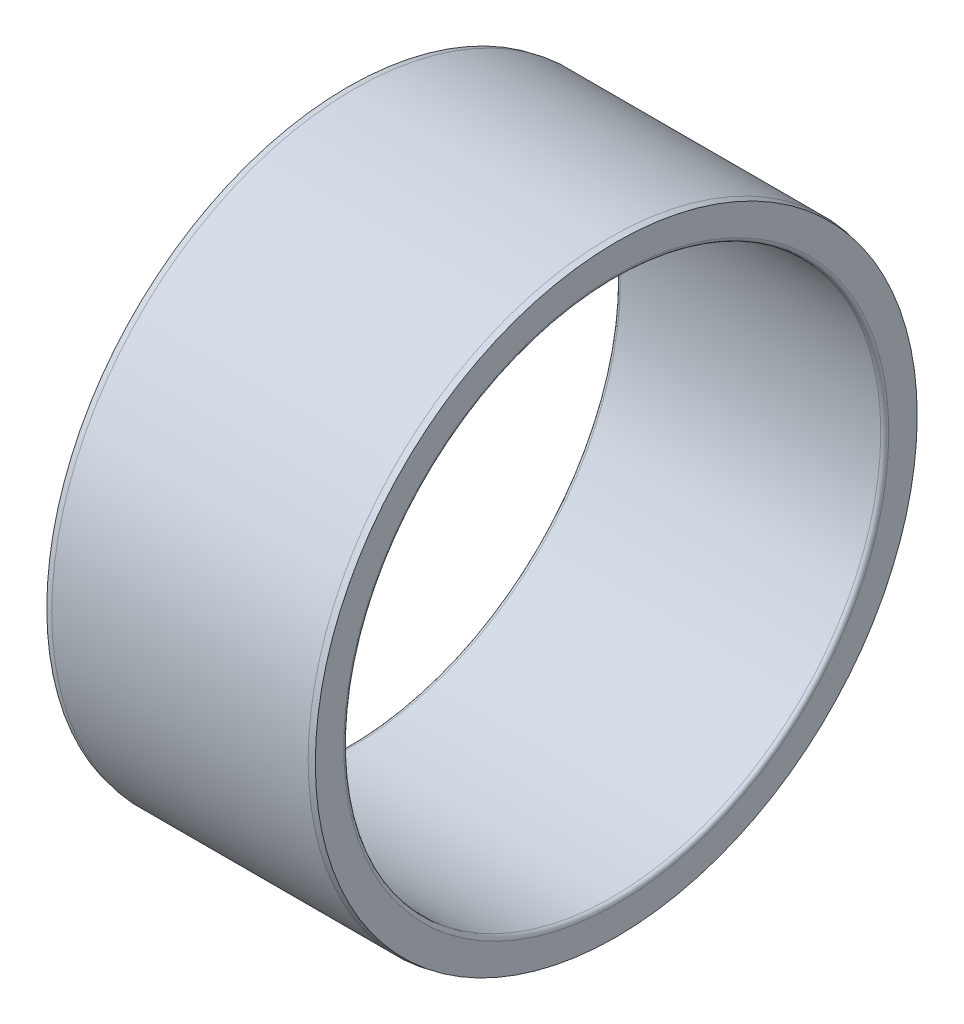
ISO-10303-21;
HEADER;
FILE_DESCRIPTION(('STEP AP214'),'2;1');
FILE_NAME('part.step','',(''),(''),'','','');
FILE_SCHEMA(('AUTOMOTIVE_DESIGN { 1 0 10303 214 1 1 1 1 }'));
ENDSEC;
DATA;
#1=APPLICATION_CONTEXT('core data for automotive mechanical design processes');
#2=APPLICATION_PROTOCOL_DEFINITION('international standard','automotive_design',2000,#1);
#3=PRODUCT_CONTEXT('',#1,'mechanical');
#4=PRODUCT('Part','Part','',(#3));
#5=PRODUCT_RELATED_PRODUCT_CATEGORY('part','',(#4));
#6=PRODUCT_DEFINITION_FORMATION('','',#4);
#7=PRODUCT_DEFINITION_CONTEXT('part definition',#1,'design');
#8=PRODUCT_DEFINITION('design','',#6,#7);
#9=PRODUCT_DEFINITION_SHAPE('','',#8);
#10=(LENGTH_UNIT() NAMED_UNIT(*) SI_UNIT(.MILLI.,.METRE.));
#11=(NAMED_UNIT(*) PLANE_ANGLE_UNIT() SI_UNIT($,.RADIAN.));
#12=(NAMED_UNIT(*) SI_UNIT($,.STERADIAN.) SOLID_ANGLE_UNIT());
#13=UNCERTAINTY_MEASURE_WITH_UNIT(LENGTH_MEASURE(1.E-05),#10,'distance_accuracy_value','');
#14=(GEOMETRIC_REPRESENTATION_CONTEXT(3) GLOBAL_UNCERTAINTY_ASSIGNED_CONTEXT((#13)) GLOBAL_UNIT_ASSIGNED_CONTEXT((#10,
#11,#12)) REPRESENTATION_CONTEXT('',''));
#15=CARTESIAN_POINT('',(0.,0.,0.));
#16=DIRECTION('',(0.,0.,1.));
#17=DIRECTION('',(1.,0.,0.));
#18=AXIS2_PLACEMENT_3D('',#15,#16,#17);
#19=CARTESIAN_POINT('',(0.,22.41563,0.));
#20=DIRECTION('',(-1.,0.,0.));
#21=DIRECTION('',(0.,0.,1.));
#22=AXIS2_PLACEMENT_3D('',#19,#20,#21);
#23=PLANE('',#22);
#24=CARTESIAN_POINT('',(0.,0.,0.));
#25=DIRECTION('',(1.,0.,0.));
#26=DIRECTION('',(0.,0.,-1.));
#27=AXIS2_PLACEMENT_3D('',#24,#25,#26);
#28=CIRCLE('',#27,20.3);
#29=CARTESIAN_POINT('',(0.,0.,-20.3));
#30=VERTEX_POINT('',#29);
#31=EDGE_CURVE('E44',#30,#30,#28,.T.);
#32=ORIENTED_EDGE('',*,*,#31,.T.);
#33=EDGE_LOOP('',(#32));
#34=FACE_BOUND('',#33,.T.);
#35=CARTESIAN_POINT('',(0.,0.,0.));
#36=DIRECTION('',(1.,0.,0.));
#37=DIRECTION('',(0.,0.,-1.));
#38=AXIS2_PLACEMENT_3D('',#35,#36,#37);
#39=CIRCLE('',#38,22.41563);
#40=CARTESIAN_POINT('',(0.,0.,-22.41563));
#41=VERTEX_POINT('',#40);
#42=EDGE_CURVE('E41',#41,#41,#39,.T.);
#43=ORIENTED_EDGE('',*,*,#42,.F.);
#44=EDGE_LOOP('',(#43));
#45=FACE_BOUND('',#44,.T.);
#46=ADVANCED_FACE('F15',(#34,#45),#23,.T.);
#47=CARTESIAN_POINT('',(0.299999999999941,0.,0.));
#48=DIRECTION('',(1.,0.,0.));
#49=DIRECTION('',(0.,0.,-1.));
#50=AXIS2_PLACEMENT_3D('',#47,#48,#49);
#51=TOROIDAL_SURFACE('',#50,20.3,0.299999999999941);
#52=CARTESIAN_POINT('',(0.3,0.,0.));
#53=DIRECTION('',(1.,0.,0.));
#54=DIRECTION('',(0.,0.,-1.));
#55=AXIS2_PLACEMENT_3D('',#52,#53,#54);
#56=CIRCLE('',#55,20.);
#57=CARTESIAN_POINT('',(0.3,0.,-20.));
#58=VERTEX_POINT('',#57);
#59=EDGE_CURVE('E38',#58,#58,#56,.T.);
#60=ORIENTED_EDGE('',*,*,#59,.T.);
#61=EDGE_LOOP('',(#60));
#62=FACE_BOUND('',#61,.T.);
#63=ORIENTED_EDGE('',*,*,#31,.F.);
#64=EDGE_LOOP('',(#63));
#65=FACE_BOUND('',#64,.T.);
#66=ADVANCED_FACE('F50',(#62,#65),#51,.T.);
#67=CARTESIAN_POINT('',(0.45,0.,0.));
#68=DIRECTION('',(1.,0.,0.));
#69=DIRECTION('',(0.,0.,-1.));
#70=AXIS2_PLACEMENT_3D('',#67,#68,#69);
#71=CONICAL_SURFACE('',#70,22.5,0.185337216221465);
#72=ORIENTED_EDGE('',*,*,#42,.T.);
#73=EDGE_LOOP('',(#72));
#74=FACE_BOUND('',#73,.T.);
#75=CARTESIAN_POINT('',(0.449999999999999,0.,0.));
#76=DIRECTION('',(1.,0.,0.));
#77=DIRECTION('',(0.,0.,-1.));
#78=AXIS2_PLACEMENT_3D('',#75,#76,#77);
#79=CIRCLE('',#78,22.5);
#80=CARTESIAN_POINT('',(0.449999999999999,0.,-22.5));
#81=VERTEX_POINT('',#80);
#82=EDGE_CURVE('E35',#81,#81,#79,.T.);
#83=ORIENTED_EDGE('',*,*,#82,.F.);
#84=EDGE_LOOP('',(#83));
#85=FACE_BOUND('',#84,.T.);
#86=ADVANCED_FACE('F52',(#74,#85),#71,.T.);
#87=CARTESIAN_POINT('',(20.,0.,0.));
#88=DIRECTION('',(1.,0.,0.));
#89=DIRECTION('',(0.,0.,-1.));
#90=AXIS2_PLACEMENT_3D('',#87,#88,#89);
#91=CYLINDRICAL_SURFACE('',#90,20.);
#92=CARTESIAN_POINT('',(19.7,0.,0.));
#93=DIRECTION('',(1.,0.,0.));
#94=DIRECTION('',(0.,0.,-1.));
#95=AXIS2_PLACEMENT_3D('',#92,#93,#94);
#96=CIRCLE('',#95,20.);
#97=CARTESIAN_POINT('',(19.7,0.,-20.));
#98=VERTEX_POINT('',#97);
#99=EDGE_CURVE('E30',#98,#98,#96,.T.);
#100=ORIENTED_EDGE('',*,*,#99,.T.);
#101=EDGE_LOOP('',(#100));
#102=FACE_BOUND('',#101,.T.);
#103=ORIENTED_EDGE('',*,*,#59,.F.);
#104=EDGE_LOOP('',(#103));
#105=FACE_BOUND('',#104,.T.);
#106=ADVANCED_FACE('F60',(#102,#105),#91,.F.);
#107=CARTESIAN_POINT('',(20.,0.,0.));
#108=DIRECTION('',(1.,0.,0.));
#109=DIRECTION('',(0.,0.,-1.));
#110=AXIS2_PLACEMENT_3D('',#107,#108,#109);
#111=CYLINDRICAL_SURFACE('',#110,22.5);
#112=ORIENTED_EDGE('',*,*,#82,.T.);
#113=EDGE_LOOP('',(#112));
#114=FACE_BOUND('',#113,.T.);
#115=CARTESIAN_POINT('',(19.55,0.,0.));
#116=DIRECTION('',(1.,0.,0.));
#117=DIRECTION('',(0.,0.,-1.));
#118=AXIS2_PLACEMENT_3D('',#115,#116,#117);
#119=CIRCLE('',#118,22.5);
#120=CARTESIAN_POINT('',(19.55,0.,-22.5));
#121=VERTEX_POINT('',#120);
#122=EDGE_CURVE('E26',#121,#121,#119,.T.);
#123=ORIENTED_EDGE('',*,*,#122,.F.);
#124=EDGE_LOOP('',(#123));
#125=FACE_BOUND('',#124,.T.);
#126=ADVANCED_FACE('F67',(#114,#125),#111,.T.);
#127=CARTESIAN_POINT('',(19.7,0.,0.));
#128=DIRECTION('',(1.,0.,0.));
#129=DIRECTION('',(0.,0.,-1.));
#130=AXIS2_PLACEMENT_3D('',#127,#128,#129);
#131=TOROIDAL_SURFACE('',#130,20.3,0.29999999999988);
#132=CARTESIAN_POINT('',(20.,0.,0.));
#133=DIRECTION('',(1.,0.,0.));
#134=DIRECTION('',(0.,0.,-1.));
#135=AXIS2_PLACEMENT_3D('',#132,#133,#134);
#136=CIRCLE('',#135,20.3);
#137=CARTESIAN_POINT('',(20.,0.,-20.3));
#138=VERTEX_POINT('',#137);
#139=EDGE_CURVE('E22',#138,#138,#136,.T.);
#140=ORIENTED_EDGE('',*,*,#139,.T.);
#141=EDGE_LOOP('',(#140));
#142=FACE_BOUND('',#141,.T.);
#143=ORIENTED_EDGE('',*,*,#99,.F.);
#144=EDGE_LOOP('',(#143));
#145=FACE_BOUND('',#144,.T.);
#146=ADVANCED_FACE('F71',(#142,#145),#131,.T.);
#147=CARTESIAN_POINT('',(20.,0.,0.));
#148=DIRECTION('',(-1.,0.,0.));
#149=DIRECTION('',(0.,0.,1.));
#150=AXIS2_PLACEMENT_3D('',#147,#148,#149);
#151=CONICAL_SURFACE('',#150,22.41563,0.185337216221465);
#152=ORIENTED_EDGE('',*,*,#122,.T.);
#153=EDGE_LOOP('',(#152));
#154=FACE_BOUND('',#153,.T.);
#155=CARTESIAN_POINT('',(20.,0.,0.));
#156=DIRECTION('',(1.,0.,0.));
#157=DIRECTION('',(0.,0.,-1.));
#158=AXIS2_PLACEMENT_3D('',#155,#156,#157);
#159=CIRCLE('',#158,22.41563);
#160=CARTESIAN_POINT('',(20.,0.,-22.41563));
#161=VERTEX_POINT('',#160);
#162=EDGE_CURVE('E10',#161,#161,#159,.T.);
#163=ORIENTED_EDGE('',*,*,#162,.F.);
#164=EDGE_LOOP('',(#163));
#165=FACE_BOUND('',#164,.T.);
#166=ADVANCED_FACE('F74',(#154,#165),#151,.T.);
#167=CARTESIAN_POINT('',(20.,20.3,0.));
#168=DIRECTION('',(1.,0.,0.));
#169=DIRECTION('',(0.,0.,-1.));
#170=AXIS2_PLACEMENT_3D('',#167,#168,#169);
#171=PLANE('',#170);
#172=ORIENTED_EDGE('',*,*,#162,.T.);
#173=EDGE_LOOP('',(#172));
#174=FACE_BOUND('',#173,.T.);
#175=ORIENTED_EDGE('',*,*,#139,.F.);
#176=EDGE_LOOP('',(#175));
#177=FACE_BOUND('',#176,.T.);
#178=ADVANCED_FACE('F17',(#174,#177),#171,.T.);
#179=CLOSED_SHELL('',(#46,#66,#86,#106,#126,#146,#166,#178));
#180=MANIFOLD_SOLID_BREP('B1',#179);
#181=ADVANCED_BREP_SHAPE_REPRESENTATION('',(#18,#180),#14);
#182=SHAPE_DEFINITION_REPRESENTATION(#9,#181);
ENDSEC;
END-ISO-10303-21;
